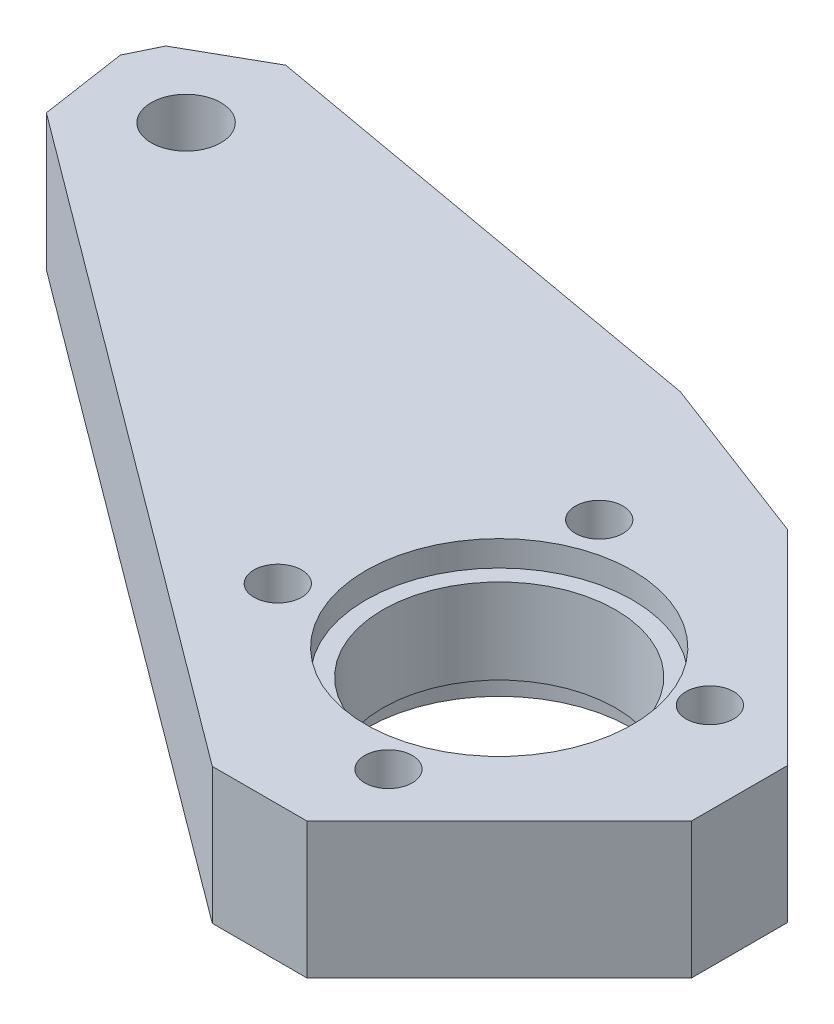
ISO-10303-21;
HEADER;
FILE_DESCRIPTION(('STEP AP214'),'2;1');
FILE_NAME('part.step','',(''),(''),'','','');
FILE_SCHEMA(('AUTOMOTIVE_DESIGN { 1 0 10303 214 1 1 1 1 }'));
ENDSEC;
DATA;
#1=APPLICATION_CONTEXT('core data for automotive mechanical design processes');
#2=APPLICATION_PROTOCOL_DEFINITION('international standard','automotive_design',2000,#1);
#3=PRODUCT_CONTEXT('',#1,'mechanical');
#4=PRODUCT('Part','Part','',(#3));
#5=PRODUCT_RELATED_PRODUCT_CATEGORY('part','',(#4));
#6=PRODUCT_DEFINITION_FORMATION('','',#4);
#7=PRODUCT_DEFINITION_CONTEXT('part definition',#1,'design');
#8=PRODUCT_DEFINITION('design','',#6,#7);
#9=PRODUCT_DEFINITION_SHAPE('','',#8);
#10=(LENGTH_UNIT() NAMED_UNIT(*) SI_UNIT(.MILLI.,.METRE.));
#11=(NAMED_UNIT(*) PLANE_ANGLE_UNIT() SI_UNIT($,.RADIAN.));
#12=(NAMED_UNIT(*) SI_UNIT($,.STERADIAN.) SOLID_ANGLE_UNIT());
#13=UNCERTAINTY_MEASURE_WITH_UNIT(LENGTH_MEASURE(1.E-05),#10,'distance_accuracy_value','');
#14=(GEOMETRIC_REPRESENTATION_CONTEXT(3) GLOBAL_UNCERTAINTY_ASSIGNED_CONTEXT((#13)) GLOBAL_UNIT_ASSIGNED_CONTEXT((#10,
#11,#12)) REPRESENTATION_CONTEXT('',''));
#15=CARTESIAN_POINT('',(0.,0.,0.));
#16=DIRECTION('',(0.,0.,1.));
#17=DIRECTION('',(1.,0.,0.));
#18=AXIS2_PLACEMENT_3D('',#15,#16,#17);
#19=CARTESIAN_POINT('',(100.000038384,-41.500004703,62.5));
#20=DIRECTION('',(0.,1.,0.));
#21=DIRECTION('',(-1.,0.,0.));
#22=AXIS2_PLACEMENT_3D('',#19,#20,#21);
#23=CYLINDRICAL_SURFACE('',#22,7.85);
#24=DIRECTION('',(0.,-1.,0.));
#25=VECTOR('',#24,1.);
#26=CARTESIAN_POINT('',(92.150038384,-35.500004703,62.5));
#27=LINE('',#26,#25);
#28=CARTESIAN_POINT('',(92.150038384,-35.500004703,62.5));
#29=VERTEX_POINT('',#28);
#30=CARTESIAN_POINT('',(92.150038384,-37.000004703,62.5));
#31=VERTEX_POINT('',#30);
#32=EDGE_CURVE('E11',#29,#31,#27,.T.);
#33=ORIENTED_EDGE('',*,*,#32,.F.);
#34=CARTESIAN_POINT('',(100.000038384,-35.500004703,62.5));
#35=DIRECTION('',(0.,-1.,0.));
#36=DIRECTION('',(0.,0.,-1.));
#37=AXIS2_PLACEMENT_3D('',#34,#35,#36);
#38=CIRCLE('',#37,7.85);
#39=CARTESIAN_POINT('',(100.000038384,-35.500004703,54.65));
#40=VERTEX_POINT('',#39);
#41=EDGE_CURVE('E56',#40,#29,#38,.T.);
#42=ORIENTED_EDGE('',*,*,#41,.F.);
#43=CARTESIAN_POINT('',(100.000038384,-35.500004703,62.5));
#44=DIRECTION('',(0.,-1.,0.));
#45=DIRECTION('',(0.,0.,-1.));
#46=AXIS2_PLACEMENT_3D('',#43,#44,#45);
#47=CIRCLE('',#46,7.85);
#48=EDGE_CURVE('E242',#29,#40,#47,.T.);
#49=ORIENTED_EDGE('',*,*,#48,.F.);
#50=ORIENTED_EDGE('',*,*,#32,.T.);
#51=CARTESIAN_POINT('',(100.000038384,-37.000004703,62.5));
#52=DIRECTION('',(0.,-1.,0.));
#53=DIRECTION('',(0.,0.,-1.));
#54=AXIS2_PLACEMENT_3D('',#51,#52,#53);
#55=CIRCLE('',#54,7.85);
#56=CARTESIAN_POINT('',(100.000038384,-37.000004703,54.65));
#57=VERTEX_POINT('',#56);
#58=EDGE_CURVE('E48',#31,#57,#55,.T.);
#59=ORIENTED_EDGE('',*,*,#58,.T.);
#60=CARTESIAN_POINT('',(100.000038384,-37.000004703,62.5));
#61=DIRECTION('',(0.,-1.,0.));
#62=DIRECTION('',(0.,0.,-1.));
#63=AXIS2_PLACEMENT_3D('',#60,#61,#62);
#64=CIRCLE('',#63,7.85);
#65=EDGE_CURVE('E331',#57,#31,#64,.T.);
#66=ORIENTED_EDGE('',*,*,#65,.T.);
#67=EDGE_LOOP('',(#33,#42,#49,#50,#59,#66));
#68=FACE_BOUND('',#67,.T.);
#69=ADVANCED_FACE('F38',(#68),#23,.F.);
#70=CARTESIAN_POINT('',(58.884612022,-41.500004703,43.005789131));
#71=DIRECTION('',(-0.898794046158572,0.,-0.438371147077341));
#72=DIRECTION('',(-0.438371147077341,0.,0.898794046158572));
#73=AXIS2_PLACEMENT_3D('',#70,#71,#72);
#74=PLANE('',#73);
#75=DIRECTION('',(-0.438371147077341,0.,0.898794046158572));
#76=VECTOR('',#75,1.);
#77=CARTESIAN_POINT('',(59.543280425,-35.500004703,41.655318775));
#78=LINE('',#77,#76);
#79=CARTESIAN_POINT('',(59.543280425,-35.500004703,41.655318775));
#80=VERTEX_POINT('',#79);
#81=CARTESIAN_POINT('',(58.666538131,-35.500004703,43.452906867));
#82=VERTEX_POINT('',#81);
#83=EDGE_CURVE('E240',#80,#82,#78,.T.);
#84=ORIENTED_EDGE('',*,*,#83,.F.);
#85=DIRECTION('',(0.,1.,0.));
#86=VECTOR('',#85,1.);
#87=CARTESIAN_POINT('',(59.543280425,-43.500004703,41.655318775));
#88=LINE('',#87,#86);
#89=CARTESIAN_POINT('',(59.543280425,-43.500004703,41.655318775));
#90=VERTEX_POINT('',#89);
#91=EDGE_CURVE('E303',#90,#80,#88,.T.);
#92=ORIENTED_EDGE('',*,*,#91,.F.);
#93=DIRECTION('',(-0.438371147077341,0.,0.898794046158572));
#94=VECTOR('',#93,1.);
#95=CARTESIAN_POINT('',(59.543280425,-43.500004703,41.655318775));
#96=LINE('',#95,#94);
#97=CARTESIAN_POINT('',(58.666538131,-43.500004703,43.452906867));
#98=VERTEX_POINT('',#97);
#99=EDGE_CURVE('E334',#90,#98,#96,.T.);
#100=ORIENTED_EDGE('',*,*,#99,.T.);
#101=DIRECTION('',(0.,1.,0.));
#102=VECTOR('',#101,1.);
#103=CARTESIAN_POINT('',(58.666538131,-43.500004703,43.452906867));
#104=LINE('',#103,#102);
#105=EDGE_CURVE('E302',#98,#82,#104,.T.);
#106=ORIENTED_EDGE('',*,*,#105,.T.);
#107=EDGE_LOOP('',(#84,#92,#100,#106));
#108=FACE_BOUND('',#107,.T.);
#109=ADVANCED_FACE('F411',(#108),#74,.T.);
#110=CARTESIAN_POINT('',(61.795778479,-41.500004703,40.380045681));
#111=DIRECTION('',(0.492678444125846,0.,0.87021144022228));
#112=DIRECTION('',(0.,-1.,0.));
#113=AXIS2_PLACEMENT_3D('',#110,#111,#112);
#114=PLANE('',#113);
#115=DIRECTION('',(0.87021144022228,0.,-0.492678444125846));
#116=VECTOR('',#115,1.);
#117=CARTESIAN_POINT('',(59.543280425,-35.500004703,41.655318775));
#118=LINE('',#117,#116);
#119=CARTESIAN_POINT('',(64.048276533,-35.500004703,39.104772588));
#120=VERTEX_POINT('',#119);
#121=EDGE_CURVE('E299',#80,#120,#118,.T.);
#122=ORIENTED_EDGE('',*,*,#121,.T.);
#123=DIRECTION('',(0.,1.,0.));
#124=VECTOR('',#123,1.);
#125=CARTESIAN_POINT('',(64.048276533,-43.500004703,39.104772588));
#126=LINE('',#125,#124);
#127=CARTESIAN_POINT('',(64.048276533,-43.500004703,39.104772588));
#128=VERTEX_POINT('',#127);
#129=EDGE_CURVE('E280',#128,#120,#126,.T.);
#130=ORIENTED_EDGE('',*,*,#129,.F.);
#131=DIRECTION('',(0.87021144022228,0.,-0.492678444125846));
#132=VECTOR('',#131,1.);
#133=CARTESIAN_POINT('',(59.543280425,-43.500004703,41.655318775));
#134=LINE('',#133,#132);
#135=EDGE_CURVE('E314',#90,#128,#134,.T.);
#136=ORIENTED_EDGE('',*,*,#135,.F.);
#137=ORIENTED_EDGE('',*,*,#91,.T.);
#138=EDGE_LOOP('',(#122,#130,#136,#137));
#139=FACE_BOUND('',#138,.T.);
#140=ADVANCED_FACE('F417',(#139),#114,.F.);
#141=CARTESIAN_POINT('',(67.774157459,-41.500004703,39.7682048));
#142=DIRECTION('',(0.175303142953365,0.,-0.984514503738097));
#143=DIRECTION('',(0.,-1.,0.));
#144=AXIS2_PLACEMENT_3D('',#141,#142,#143);
#145=PLANE('',#144);
#146=DIRECTION('',(-0.984514503738097,0.,-0.175303142953365));
#147=VECTOR('',#146,1.);
#148=CARTESIAN_POINT('',(92.286977054,-35.500004703,44.132969661));
#149=LINE('',#148,#147);
#150=CARTESIAN_POINT('',(92.286977054,-35.500004703,44.132969661));
#151=VERTEX_POINT('',#150);
#152=EDGE_CURVE('E234',#151,#120,#149,.T.);
#153=ORIENTED_EDGE('',*,*,#152,.F.);
#154=DIRECTION('',(0.,1.,0.));
#155=VECTOR('',#154,1.);
#156=CARTESIAN_POINT('',(92.286977054,-43.500004703,44.132969661));
#157=LINE('',#156,#155);
#158=CARTESIAN_POINT('',(92.286977054,-43.500004703,44.132969661));
#159=VERTEX_POINT('',#158);
#160=EDGE_CURVE('E288',#159,#151,#157,.T.);
#161=ORIENTED_EDGE('',*,*,#160,.F.);
#162=DIRECTION('',(-0.984514503738097,0.,-0.175303142953365));
#163=VECTOR('',#162,1.);
#164=CARTESIAN_POINT('',(92.286977054,-43.500004703,44.132969661));
#165=LINE('',#164,#163);
#166=EDGE_CURVE('E282',#159,#128,#165,.T.);
#167=ORIENTED_EDGE('',*,*,#166,.T.);
#168=ORIENTED_EDGE('',*,*,#129,.T.);
#169=EDGE_LOOP('',(#153,#161,#167,#168));
#170=FACE_BOUND('',#169,.T.);
#171=ADVANCED_FACE('F425',(#170),#145,.T.);
#172=CARTESIAN_POINT('',(97.380944586,-41.500004703,46.068640323));
#173=DIRECTION('',(0.355211827987967,0.,-0.934785834968335));
#174=DIRECTION('',(0.,-1.,0.));
#175=AXIS2_PLACEMENT_3D('',#172,#173,#174);
#176=PLANE('',#175);
#177=DIRECTION('',(-0.934785834968335,0.,-0.355211827987967));
#178=VECTOR('',#177,1.);
#179=CARTESIAN_POINT('',(102.474912119,-35.500004703,48.004310986));
#180=LINE('',#179,#178);
#181=CARTESIAN_POINT('',(102.474912119,-35.500004703,48.004310986));
#182=VERTEX_POINT('',#181);
#183=EDGE_CURVE('E236',#182,#151,#180,.T.);
#184=ORIENTED_EDGE('',*,*,#183,.F.);
#185=DIRECTION('',(0.,1.,0.));
#186=VECTOR('',#185,1.);
#187=CARTESIAN_POINT('',(102.474912119,-43.500004703,48.004310986));
#188=LINE('',#187,#186);
#189=CARTESIAN_POINT('',(102.474912119,-43.500004703,48.004310986));
#190=VERTEX_POINT('',#189);
#191=EDGE_CURVE('E261',#190,#182,#188,.T.);
#192=ORIENTED_EDGE('',*,*,#191,.F.);
#193=DIRECTION('',(-0.934785834968335,0.,-0.355211827987967));
#194=VECTOR('',#193,1.);
#195=CARTESIAN_POINT('',(102.474912119,-43.500004703,48.004310986));
#196=LINE('',#195,#194);
#197=EDGE_CURVE('E283',#190,#159,#196,.T.);
#198=ORIENTED_EDGE('',*,*,#197,.T.);
#199=ORIENTED_EDGE('',*,*,#160,.T.);
#200=EDGE_LOOP('',(#184,#192,#198,#199));
#201=FACE_BOUND('',#200,.T.);
#202=ADVANCED_FACE('F421',(#201),#176,.T.);
#203=CARTESIAN_POINT('',(111.490523579,-41.500004703,57.019922446));
#204=DIRECTION('',(-0.707106781186548,0.,0.707106781186548));
#205=DIRECTION('',(0.,1.,0.));
#206=AXIS2_PLACEMENT_3D('',#203,#204,#205);
#207=PLANE('',#206);
#208=DIRECTION('',(0.707106781186548,0.,0.707106781186548));
#209=VECTOR('',#208,1.);
#210=CARTESIAN_POINT('',(102.474912119,-35.500004703,48.004310986));
#211=LINE('',#210,#209);
#212=CARTESIAN_POINT('',(114.495727399,-35.500004703,60.025126266));
#213=VERTEX_POINT('',#212);
#214=EDGE_CURVE('E264',#182,#213,#211,.T.);
#215=ORIENTED_EDGE('',*,*,#214,.T.);
#216=DIRECTION('',(0.,1.,0.));
#217=VECTOR('',#216,1.);
#218=CARTESIAN_POINT('',(114.495727399,-43.500004703,60.025126266));
#219=LINE('',#218,#217);
#220=CARTESIAN_POINT('',(114.495727399,-43.500004703,60.025126266));
#221=VERTEX_POINT('',#220);
#222=EDGE_CURVE('E343',#221,#213,#219,.T.);
#223=ORIENTED_EDGE('',*,*,#222,.F.);
#224=DIRECTION('',(0.707106781186548,0.,0.707106781186548));
#225=VECTOR('',#224,1.);
#226=CARTESIAN_POINT('',(102.474912119,-43.500004703,48.004310986));
#227=LINE('',#226,#225);
#228=EDGE_CURVE('E321',#190,#221,#227,.T.);
#229=ORIENTED_EDGE('',*,*,#228,.F.);
#230=ORIENTED_EDGE('',*,*,#191,.T.);
#231=EDGE_LOOP('',(#215,#223,#229,#230));
#232=FACE_BOUND('',#231,.T.);
#233=ADVANCED_FACE('F424',(#232),#207,.F.);
#234=CARTESIAN_POINT('',(114.495727399,-41.500004703,62.853553391));
#235=DIRECTION('',(1.,0.,0.));
#236=DIRECTION('',(0.,1.,0.));
#237=AXIS2_PLACEMENT_3D('',#234,#235,#236);
#238=PLANE('',#237);
#239=DIRECTION('',(0.,0.,-1.));
#240=VECTOR('',#239,1.);
#241=CARTESIAN_POINT('',(114.495727399,-35.500004703,65.681980515));
#242=LINE('',#241,#240);
#243=CARTESIAN_POINT('',(114.495727399,-35.500004703,65.681980515));
#244=VERTEX_POINT('',#243);
#245=EDGE_CURVE('E239',#244,#213,#242,.T.);
#246=ORIENTED_EDGE('',*,*,#245,.F.);
#247=DIRECTION('',(0.,1.,0.));
#248=VECTOR('',#247,1.);
#249=CARTESIAN_POINT('',(114.495727399,-43.500004703,65.681980515));
#250=LINE('',#249,#248);
#251=CARTESIAN_POINT('',(114.495727399,-43.500004703,65.681980515));
#252=VERTEX_POINT('',#251);
#253=EDGE_CURVE('E307',#252,#244,#250,.T.);
#254=ORIENTED_EDGE('',*,*,#253,.F.);
#255=DIRECTION('',(0.,0.,-1.));
#256=VECTOR('',#255,1.);
#257=CARTESIAN_POINT('',(114.495727399,-43.500004703,65.681980515));
#258=LINE('',#257,#256);
#259=EDGE_CURVE('E265',#252,#221,#258,.T.);
#260=ORIENTED_EDGE('',*,*,#259,.T.);
#261=ORIENTED_EDGE('',*,*,#222,.T.);
#262=EDGE_LOOP('',(#246,#254,#260,#261));
#263=FACE_BOUND('',#262,.T.);
#264=ADVANCED_FACE('F585',(#263),#238,.T.);
#265=CARTESIAN_POINT('',(111.667300274,-41.500004703,68.51040764));
#266=DIRECTION('',(0.707106781186548,0.,0.707106781186548));
#267=DIRECTION('',(0.,-1.,0.));
#268=AXIS2_PLACEMENT_3D('',#265,#266,#267);
#269=PLANE('',#268);
#270=DIRECTION('',(0.707106781186548,0.,-0.707106781186548));
#271=VECTOR('',#270,1.);
#272=CARTESIAN_POINT('',(103.1820189,-35.500004703,76.995689014));
#273=LINE('',#272,#271);
#274=CARTESIAN_POINT('',(103.1820189,-35.500004703,76.995689014));
#275=VERTEX_POINT('',#274);
#276=EDGE_CURVE('E311',#275,#244,#273,.T.);
#277=ORIENTED_EDGE('',*,*,#276,.F.);
#278=DIRECTION('',(0.,1.,0.));
#279=VECTOR('',#278,1.);
#280=CARTESIAN_POINT('',(103.1820189,-43.500004703,76.995689014));
#281=LINE('',#280,#279);
#282=CARTESIAN_POINT('',(103.1820189,-43.500004703,76.995689014));
#283=VERTEX_POINT('',#282);
#284=EDGE_CURVE('E298',#283,#275,#281,.T.);
#285=ORIENTED_EDGE('',*,*,#284,.F.);
#286=DIRECTION('',(0.707106781186548,0.,-0.707106781186548));
#287=VECTOR('',#286,1.);
#288=CARTESIAN_POINT('',(103.1820189,-43.500004703,76.995689014));
#289=LINE('',#288,#287);
#290=EDGE_CURVE('E345',#283,#252,#289,.T.);
#291=ORIENTED_EDGE('',*,*,#290,.T.);
#292=ORIENTED_EDGE('',*,*,#253,.T.);
#293=EDGE_LOOP('',(#277,#285,#291,#292));
#294=FACE_BOUND('',#293,.T.);
#295=ADVANCED_FACE('F440',(#294),#269,.T.);
#296=CARTESIAN_POINT('',(100.3985189,-41.500004703,76.995689014));
#297=DIRECTION('',(0.,0.,-1.));
#298=DIRECTION('',(0.,-1.,0.));
#299=AXIS2_PLACEMENT_3D('',#296,#297,#298);
#300=PLANE('',#299);
#301=DIRECTION('',(-1.,0.,0.));
#302=VECTOR('',#301,1.);
#303=CARTESIAN_POINT('',(103.1820189,-35.500004703,76.995689014));
#304=LINE('',#303,#302);
#305=CARTESIAN_POINT('',(97.6150189,-35.500004703,76.995689014));
#306=VERTEX_POINT('',#305);
#307=EDGE_CURVE('E304',#275,#306,#304,.T.);
#308=ORIENTED_EDGE('',*,*,#307,.T.);
#309=DIRECTION('',(0.,1.,0.));
#310=VECTOR('',#309,1.);
#311=CARTESIAN_POINT('',(97.6150189,-43.500004703,76.995689014));
#312=LINE('',#311,#310);
#313=CARTESIAN_POINT('',(97.6150189,-43.500004703,76.995689014));
#314=VERTEX_POINT('',#313);
#315=EDGE_CURVE('E252',#314,#306,#312,.T.);
#316=ORIENTED_EDGE('',*,*,#315,.F.);
#317=DIRECTION('',(-1.,0.,0.));
#318=VECTOR('',#317,1.);
#319=CARTESIAN_POINT('',(103.1820189,-43.500004703,76.995689014));
#320=LINE('',#319,#318);
#321=EDGE_CURVE('E323',#283,#314,#320,.T.);
#322=ORIENTED_EDGE('',*,*,#321,.F.);
#323=ORIENTED_EDGE('',*,*,#284,.T.);
#324=EDGE_LOOP('',(#308,#316,#322,#323));
#325=FACE_BOUND('',#324,.T.);
#326=ADVANCED_FACE('F438',(#325),#300,.F.);
#327=CARTESIAN_POINT('',(78.522625879,-41.500004703,62.784427144));
#328=DIRECTION('',(0.597091058794646,0.,-0.802173464724113));
#329=DIRECTION('',(0.,-1.,0.));
#330=AXIS2_PLACEMENT_3D('',#327,#328,#329);
#331=PLANE('',#330);
#332=DIRECTION('',(-0.802173464724113,0.,-0.597091058794646));
#333=VECTOR('',#332,1.);
#334=CARTESIAN_POINT('',(97.6150189,-35.500004703,76.995689014));
#335=LINE('',#334,#333);
#336=CARTESIAN_POINT('',(59.430232858,-35.500004703,48.573165274));
#337=VERTEX_POINT('',#336);
#338=EDGE_CURVE('E295',#306,#337,#335,.T.);
#339=ORIENTED_EDGE('',*,*,#338,.T.);
#340=DIRECTION('',(0.,1.,0.));
#341=VECTOR('',#340,1.);
#342=CARTESIAN_POINT('',(59.430232858,-43.500004703,48.573165274));
#343=LINE('',#342,#341);
#344=CARTESIAN_POINT('',(59.430232858,-43.500004703,48.573165274));
#345=VERTEX_POINT('',#344);
#346=EDGE_CURVE('E266',#345,#337,#343,.T.);
#347=ORIENTED_EDGE('',*,*,#346,.F.);
#348=DIRECTION('',(-0.802173464724113,0.,-0.597091058794646));
#349=VECTOR('',#348,1.);
#350=CARTESIAN_POINT('',(97.6150189,-43.500004703,76.995689014));
#351=LINE('',#350,#349);
#352=EDGE_CURVE('E42',#314,#345,#351,.T.);
#353=ORIENTED_EDGE('',*,*,#352,.F.);
#354=ORIENTED_EDGE('',*,*,#315,.T.);
#355=EDGE_LOOP('',(#339,#347,#353,#354));
#356=FACE_BOUND('',#355,.T.);
#357=ADVANCED_FACE('F436',(#356),#331,.F.);
#358=CARTESIAN_POINT('',(102.940745878,-41.500004703,71.955185756));
#359=DIRECTION('',(0.,1.,0.));
#360=DIRECTION('',(-1.,0.,0.));
#361=AXIS2_PLACEMENT_3D('',#358,#359,#360);
#362=CYLINDRICAL_SURFACE('',#361,1.4);
#363=DIRECTION('',(0.,-1.,0.));
#364=VECTOR('',#363,1.);
#365=CARTESIAN_POINT('',(101.540745878,-35.500004703,71.955185756));
#366=LINE('',#365,#364);
#367=CARTESIAN_POINT('',(101.540745878,-35.500004703,71.955185756));
#368=VERTEX_POINT('',#367);
#369=CARTESIAN_POINT('',(101.540745878,-43.500004703,71.955185756));
#370=VERTEX_POINT('',#369);
#371=EDGE_CURVE('E218',#368,#370,#366,.T.);
#372=ORIENTED_EDGE('',*,*,#371,.F.);
#373=CARTESIAN_POINT('',(102.940745878,-35.500004703,71.955185756));
#374=DIRECTION('',(0.,-1.,0.));
#375=DIRECTION('',(1.,0.,0.));
#376=AXIS2_PLACEMENT_3D('',#373,#374,#375);
#377=CIRCLE('',#376,1.4);
#378=CARTESIAN_POINT('',(104.340745878,-35.500004703,71.955185756));
#379=VERTEX_POINT('',#378);
#380=EDGE_CURVE('E212',#379,#368,#377,.T.);
#381=ORIENTED_EDGE('',*,*,#380,.F.);
#382=CARTESIAN_POINT('',(102.940745878,-35.500004703,71.955185756));
#383=DIRECTION('',(0.,-1.,0.));
#384=DIRECTION('',(1.,0.,0.));
#385=AXIS2_PLACEMENT_3D('',#382,#383,#384);
#386=CIRCLE('',#385,1.4);
#387=EDGE_CURVE('E216',#368,#379,#386,.T.);
#388=ORIENTED_EDGE('',*,*,#387,.F.);
#389=ORIENTED_EDGE('',*,*,#371,.T.);
#390=CARTESIAN_POINT('',(102.940745878,-43.500004703,71.955185756));
#391=DIRECTION('',(0.,-1.,0.));
#392=DIRECTION('',(0.,0.,-1.));
#393=AXIS2_PLACEMENT_3D('',#390,#391,#392);
#394=CIRCLE('',#393,1.4);
#395=CARTESIAN_POINT('',(102.940745878,-43.500004703,70.555185756));
#396=VERTEX_POINT('',#395);
#397=EDGE_CURVE('E253',#370,#396,#394,.T.);
#398=ORIENTED_EDGE('',*,*,#397,.T.);
#399=CARTESIAN_POINT('',(102.940745878,-43.500004703,71.955185756));
#400=DIRECTION('',(0.,-1.,0.));
#401=DIRECTION('',(0.,0.,-1.));
#402=AXIS2_PLACEMENT_3D('',#399,#400,#401);
#403=CIRCLE('',#402,1.4);
#404=EDGE_CURVE('E290',#396,#370,#403,.T.);
#405=ORIENTED_EDGE('',*,*,#404,.T.);
#406=EDGE_LOOP('',(#372,#381,#388,#389,#398,#405));
#407=FACE_BOUND('',#406,.T.);
#408=ADVANCED_FACE('F214',(#407),#362,.F.);
#409=CARTESIAN_POINT('',(90.229878577,-41.500004703,65.755681545));
#410=DIRECTION('',(0.,1.,0.));
#411=DIRECTION('',(-1.,0.,0.));
#412=AXIS2_PLACEMENT_3D('',#409,#410,#411);
#413=CYLINDRICAL_SURFACE('',#412,1.4);
#414=DIRECTION('',(0.,-1.,0.));
#415=VECTOR('',#414,1.);
#416=CARTESIAN_POINT('',(88.829878577,-35.500004703,65.755681545));
#417=LINE('',#416,#415);
#418=CARTESIAN_POINT('',(88.829878577,-35.500004703,65.755681545));
#419=VERTEX_POINT('',#418);
#420=CARTESIAN_POINT('',(88.829878577,-43.500004703,65.755681545));
#421=VERTEX_POINT('',#420);
#422=EDGE_CURVE('E246',#419,#421,#417,.T.);
#423=ORIENTED_EDGE('',*,*,#422,.F.);
#424=CARTESIAN_POINT('',(90.229878577,-35.500004703,65.755681545));
#425=DIRECTION('',(0.,-1.,0.));
#426=DIRECTION('',(1.,0.,0.));
#427=AXIS2_PLACEMENT_3D('',#424,#425,#426);
#428=CIRCLE('',#427,1.4);
#429=CARTESIAN_POINT('',(91.629878577,-35.500004703,65.755681545));
#430=VERTEX_POINT('',#429);
#431=EDGE_CURVE('E256',#430,#419,#428,.T.);
#432=ORIENTED_EDGE('',*,*,#431,.F.);
#433=CARTESIAN_POINT('',(90.229878577,-35.500004703,65.755681545));
#434=DIRECTION('',(0.,-1.,0.));
#435=DIRECTION('',(1.,0.,0.));
#436=AXIS2_PLACEMENT_3D('',#433,#434,#435);
#437=CIRCLE('',#436,1.4);
#438=EDGE_CURVE('E220',#419,#430,#437,.T.);
#439=ORIENTED_EDGE('',*,*,#438,.F.);
#440=ORIENTED_EDGE('',*,*,#422,.T.);
#441=CARTESIAN_POINT('',(90.229878577,-43.500004703,65.755681545));
#442=DIRECTION('',(0.,-1.,0.));
#443=DIRECTION('',(0.,0.,-1.));
#444=AXIS2_PLACEMENT_3D('',#441,#442,#443);
#445=CIRCLE('',#444,1.4);
#446=CARTESIAN_POINT('',(90.229878577,-43.500004703,64.355681545));
#447=VERTEX_POINT('',#446);
#448=EDGE_CURVE('E244',#421,#447,#445,.T.);
#449=ORIENTED_EDGE('',*,*,#448,.T.);
#450=CARTESIAN_POINT('',(90.229878577,-43.500004703,65.755681545));
#451=DIRECTION('',(0.,-1.,0.));
#452=DIRECTION('',(0.,0.,-1.));
#453=AXIS2_PLACEMENT_3D('',#450,#451,#452);
#454=CIRCLE('',#453,1.4);
#455=EDGE_CURVE('E247',#447,#421,#454,.T.);
#456=ORIENTED_EDGE('',*,*,#455,.T.);
#457=EDGE_LOOP('',(#423,#432,#439,#440,#449,#456));
#458=FACE_BOUND('',#457,.T.);
#459=ADVANCED_FACE('F435',(#458),#413,.F.);
#460=CARTESIAN_POINT('',(64.046053168,-41.500004703,44.969712702));
#461=DIRECTION('',(0.,1.,0.));
#462=DIRECTION('',(-1.,0.,0.));
#463=AXIS2_PLACEMENT_3D('',#460,#461,#462);
#464=CYLINDRICAL_SURFACE('',#463,2.05);
#465=DIRECTION('',(0.,-1.,0.));
#466=VECTOR('',#465,1.);
#467=CARTESIAN_POINT('',(61.996053168,-35.500004703,44.969712702));
#468=LINE('',#467,#466);
#469=CARTESIAN_POINT('',(61.996053168,-35.500004703,44.969712702));
#470=VERTEX_POINT('',#469);
#471=CARTESIAN_POINT('',(61.996053168,-43.500004703,44.969712702));
#472=VERTEX_POINT('',#471);
#473=EDGE_CURVE('E272',#470,#472,#468,.T.);
#474=ORIENTED_EDGE('',*,*,#473,.F.);
#475=CARTESIAN_POINT('',(64.046053168,-35.500004703,44.969712702));
#476=DIRECTION('',(0.,-1.,0.));
#477=DIRECTION('',(0.,0.,-1.));
#478=AXIS2_PLACEMENT_3D('',#475,#476,#477);
#479=CIRCLE('',#478,2.05);
#480=CARTESIAN_POINT('',(64.046053168,-35.500004703,42.919712702));
#481=VERTEX_POINT('',#480);
#482=EDGE_CURVE('E248',#481,#470,#479,.T.);
#483=ORIENTED_EDGE('',*,*,#482,.F.);
#484=CARTESIAN_POINT('',(64.046053168,-35.500004703,44.969712702));
#485=DIRECTION('',(0.,-1.,0.));
#486=DIRECTION('',(0.,0.,-1.));
#487=AXIS2_PLACEMENT_3D('',#484,#485,#486);
#488=CIRCLE('',#487,2.05);
#489=EDGE_CURVE('E250',#470,#481,#488,.T.);
#490=ORIENTED_EDGE('',*,*,#489,.F.);
#491=ORIENTED_EDGE('',*,*,#473,.T.);
#492=CARTESIAN_POINT('',(64.046053168,-43.500004703,44.969712702));
#493=DIRECTION('',(0.,-1.,0.));
#494=DIRECTION('',(0.,0.,-1.));
#495=AXIS2_PLACEMENT_3D('',#492,#493,#494);
#496=CIRCLE('',#495,2.05);
#497=CARTESIAN_POINT('',(64.046053168,-43.500004703,42.919712702));
#498=VERTEX_POINT('',#497);
#499=EDGE_CURVE('E349',#472,#498,#496,.T.);
#500=ORIENTED_EDGE('',*,*,#499,.T.);
#501=CARTESIAN_POINT('',(64.046053168,-43.500004703,44.969712702));
#502=DIRECTION('',(0.,-1.,0.));
#503=DIRECTION('',(0.,0.,-1.));
#504=AXIS2_PLACEMENT_3D('',#501,#502,#503);
#505=CIRCLE('',#504,2.05);
#506=EDGE_CURVE('E351',#498,#472,#505,.T.);
#507=ORIENTED_EDGE('',*,*,#506,.T.);
#508=EDGE_LOOP('',(#474,#483,#490,#491,#500,#507));
#509=FACE_BOUND('',#508,.T.);
#510=ADVANCED_FACE('F40',(#509),#464,.F.);
#511=CARTESIAN_POINT('',(109.140250089,-41.500004703,59.244318455));
#512=DIRECTION('',(0.,1.,0.));
#513=DIRECTION('',(-1.,0.,0.));
#514=AXIS2_PLACEMENT_3D('',#511,#512,#513);
#515=CYLINDRICAL_SURFACE('',#514,1.4);
#516=DIRECTION('',(0.,-1.,0.));
#517=VECTOR('',#516,1.);
#518=CARTESIAN_POINT('',(107.740250089,-35.500004703,59.244318455));
#519=LINE('',#518,#517);
#520=CARTESIAN_POINT('',(107.740250089,-35.500004703,59.244318455));
#521=VERTEX_POINT('',#520);
#522=CARTESIAN_POINT('',(107.740250089,-43.500004703,59.244318455));
#523=VERTEX_POINT('',#522);
#524=EDGE_CURVE('E360',#521,#523,#519,.T.);
#525=ORIENTED_EDGE('',*,*,#524,.F.);
#526=CARTESIAN_POINT('',(109.140250089,-35.500004703,59.244318455));
#527=DIRECTION('',(0.,-1.,0.));
#528=DIRECTION('',(1.,0.,0.));
#529=AXIS2_PLACEMENT_3D('',#526,#527,#528);
#530=CIRCLE('',#529,1.4);
#531=CARTESIAN_POINT('',(110.540250089,-35.500004703,59.244318455));
#532=VERTEX_POINT('',#531);
#533=EDGE_CURVE('E232',#532,#521,#530,.T.);
#534=ORIENTED_EDGE('',*,*,#533,.F.);
#535=CARTESIAN_POINT('',(109.140250089,-35.500004703,59.244318455));
#536=DIRECTION('',(0.,-1.,0.));
#537=DIRECTION('',(1.,0.,0.));
#538=AXIS2_PLACEMENT_3D('',#535,#536,#537);
#539=CIRCLE('',#538,1.4);
#540=EDGE_CURVE('E235',#521,#532,#539,.T.);
#541=ORIENTED_EDGE('',*,*,#540,.F.);
#542=ORIENTED_EDGE('',*,*,#524,.T.);
#543=CARTESIAN_POINT('',(109.140250089,-43.500004703,59.244318455));
#544=DIRECTION('',(0.,-1.,0.));
#545=DIRECTION('',(0.,0.,-1.));
#546=AXIS2_PLACEMENT_3D('',#543,#544,#545);
#547=CIRCLE('',#546,1.4);
#548=CARTESIAN_POINT('',(109.140250089,-43.500004703,57.844318455));
#549=VERTEX_POINT('',#548);
#550=EDGE_CURVE('E230',#523,#549,#547,.T.);
#551=ORIENTED_EDGE('',*,*,#550,.T.);
#552=CARTESIAN_POINT('',(109.140250089,-43.500004703,59.244318455));
#553=DIRECTION('',(0.,-1.,0.));
#554=DIRECTION('',(0.,0.,-1.));
#555=AXIS2_PLACEMENT_3D('',#552,#553,#554);
#556=CIRCLE('',#555,1.4);
#557=EDGE_CURVE('E328',#549,#523,#556,.T.);
#558=ORIENTED_EDGE('',*,*,#557,.T.);
#559=EDGE_LOOP('',(#525,#534,#541,#542,#551,#558));
#560=FACE_BOUND('',#559,.T.);
#561=ADVANCED_FACE('F532',(#560),#515,.F.);
#562=CARTESIAN_POINT('',(59.048385495,-41.500004703,46.013036071));
#563=DIRECTION('',(-0.989059110454982,0.,0.14751974791871));
#564=DIRECTION('',(0.,1.,0.));
#565=AXIS2_PLACEMENT_3D('',#562,#563,#564);
#566=PLANE('',#565);
#567=DIRECTION('',(0.14751974791871,0.,0.989059110454982));
#568=VECTOR('',#567,1.);
#569=CARTESIAN_POINT('',(58.666538131,-35.500004703,43.452906867));
#570=LINE('',#569,#568);
#571=EDGE_CURVE('E243',#82,#337,#570,.T.);
#572=ORIENTED_EDGE('',*,*,#571,.F.);
#573=ORIENTED_EDGE('',*,*,#105,.F.);
#574=DIRECTION('',(0.14751974791871,0.,0.989059110454982));
#575=VECTOR('',#574,1.);
#576=CARTESIAN_POINT('',(58.666538131,-43.500004703,43.452906867));
#577=LINE('',#576,#575);
#578=EDGE_CURVE('E268',#98,#345,#577,.T.);
#579=ORIENTED_EDGE('',*,*,#578,.T.);
#580=ORIENTED_EDGE('',*,*,#346,.T.);
#581=EDGE_LOOP('',(#572,#573,#579,#580));
#582=FACE_BOUND('',#581,.T.);
#583=ADVANCED_FACE('F456',(#582),#566,.T.);
#584=CARTESIAN_POINT('',(100.000038384,-41.500004703,62.5));
#585=DIRECTION('',(0.,1.,0.));
#586=DIRECTION('',(-1.,0.,0.));
#587=AXIS2_PLACEMENT_3D('',#584,#585,#586);
#588=CYLINDRICAL_SURFACE('',#587,7.8);
#589=DIRECTION('',(0.,-1.,0.));
#590=VECTOR('',#589,1.);
#591=CARTESIAN_POINT('',(92.200038384,-42.000004703,62.5));
#592=LINE('',#591,#590);
#593=CARTESIAN_POINT('',(92.200038384,-42.000004703,62.5));
#594=VERTEX_POINT('',#593);
#595=CARTESIAN_POINT('',(92.200038384,-43.500004703,62.5));
#596=VERTEX_POINT('',#595);
#597=EDGE_CURVE('E269',#594,#596,#592,.T.);
#598=ORIENTED_EDGE('',*,*,#597,.F.);
#599=CARTESIAN_POINT('',(100.000038384,-42.000004703,62.5));
#600=DIRECTION('',(0.,-1.,0.));
#601=DIRECTION('',(0.,0.,-1.));
#602=AXIS2_PLACEMENT_3D('',#599,#600,#601);
#603=CIRCLE('',#602,7.8);
#604=CARTESIAN_POINT('',(100.000038384,-42.000004703,54.7));
#605=VERTEX_POINT('',#604);
#606=EDGE_CURVE('E260',#605,#594,#603,.T.);
#607=ORIENTED_EDGE('',*,*,#606,.F.);
#608=CARTESIAN_POINT('',(100.000038384,-42.000004703,62.5));
#609=DIRECTION('',(0.,-1.,0.));
#610=DIRECTION('',(0.,0.,-1.));
#611=AXIS2_PLACEMENT_3D('',#608,#609,#610);
#612=CIRCLE('',#611,7.8);
#613=EDGE_CURVE('E293',#594,#605,#612,.T.);
#614=ORIENTED_EDGE('',*,*,#613,.F.);
#615=ORIENTED_EDGE('',*,*,#597,.T.);
#616=CARTESIAN_POINT('',(100.000038384,-43.500004703,62.5));
#617=DIRECTION('',(0.,-1.,0.));
#618=DIRECTION('',(0.,0.,-1.));
#619=AXIS2_PLACEMENT_3D('',#616,#617,#618);
#620=CIRCLE('',#619,7.8);
#621=CARTESIAN_POINT('',(100.000038384,-43.500004703,54.7));
#622=VERTEX_POINT('',#621);
#623=EDGE_CURVE('E324',#596,#622,#620,.T.);
#624=ORIENTED_EDGE('',*,*,#623,.T.);
#625=CARTESIAN_POINT('',(100.000038384,-43.500004703,62.5));
#626=DIRECTION('',(0.,-1.,0.));
#627=DIRECTION('',(0.,0.,-1.));
#628=AXIS2_PLACEMENT_3D('',#625,#626,#627);
#629=CIRCLE('',#628,7.8);
#630=EDGE_CURVE('E278',#622,#596,#629,.T.);
#631=ORIENTED_EDGE('',*,*,#630,.T.);
#632=EDGE_LOOP('',(#598,#607,#614,#615,#624,#631));
#633=FACE_BOUND('',#632,.T.);
#634=ADVANCED_FACE('F429',(#633),#588,.F.);
#635=CARTESIAN_POINT('',(96.429382788,-41.500004703,53.044814244));
#636=DIRECTION('',(0.,1.,0.));
#637=DIRECTION('',(-1.,0.,0.));
#638=AXIS2_PLACEMENT_3D('',#635,#636,#637);
#639=CYLINDRICAL_SURFACE('',#638,1.4);
#640=DIRECTION('',(0.,-1.,0.));
#641=VECTOR('',#640,1.);
#642=CARTESIAN_POINT('',(95.029382788,-35.500004703,53.044814244));
#643=LINE('',#642,#641);
#644=CARTESIAN_POINT('',(95.029382788,-35.500004703,53.044814244));
#645=VERTEX_POINT('',#644);
#646=CARTESIAN_POINT('',(95.029382788,-43.500004703,53.044814244));
#647=VERTEX_POINT('',#646);
#648=EDGE_CURVE('E275',#645,#647,#643,.T.);
#649=ORIENTED_EDGE('',*,*,#648,.F.);
#650=CARTESIAN_POINT('',(96.429382788,-35.500004703,53.044814244));
#651=DIRECTION('',(0.,-1.,0.));
#652=DIRECTION('',(1.,0.,0.));
#653=AXIS2_PLACEMENT_3D('',#650,#651,#652);
#654=CIRCLE('',#653,1.4);
#655=CARTESIAN_POINT('',(97.829382788,-35.500004703,53.044814244));
#656=VERTEX_POINT('',#655);
#657=EDGE_CURVE('E224',#656,#645,#654,.T.);
#658=ORIENTED_EDGE('',*,*,#657,.F.);
#659=CARTESIAN_POINT('',(96.429382788,-35.500004703,53.044814244));
#660=DIRECTION('',(0.,-1.,0.));
#661=DIRECTION('',(1.,0.,0.));
#662=AXIS2_PLACEMENT_3D('',#659,#660,#661);
#663=CIRCLE('',#662,1.4);
#664=EDGE_CURVE('E226',#645,#656,#663,.T.);
#665=ORIENTED_EDGE('',*,*,#664,.F.);
#666=ORIENTED_EDGE('',*,*,#648,.T.);
#667=CARTESIAN_POINT('',(96.429382788,-43.500004703,53.044814244));
#668=DIRECTION('',(0.,-1.,0.));
#669=DIRECTION('',(0.,0.,-1.));
#670=AXIS2_PLACEMENT_3D('',#667,#668,#669);
#671=CIRCLE('',#670,1.4);
#672=CARTESIAN_POINT('',(96.429382788,-43.500004703,51.644814244));
#673=VERTEX_POINT('',#672);
#674=EDGE_CURVE('E279',#647,#673,#671,.T.);
#675=ORIENTED_EDGE('',*,*,#674,.T.);
#676=CARTESIAN_POINT('',(96.429382788,-43.500004703,53.044814244));
#677=DIRECTION('',(0.,-1.,0.));
#678=DIRECTION('',(0.,0.,-1.));
#679=AXIS2_PLACEMENT_3D('',#676,#677,#678);
#680=CIRCLE('',#679,1.4);
#681=EDGE_CURVE('E285',#673,#647,#680,.T.);
#682=ORIENTED_EDGE('',*,*,#681,.T.);
#683=EDGE_LOOP('',(#649,#658,#665,#666,#675,#682));
#684=FACE_BOUND('',#683,.T.);
#685=ADVANCED_FACE('F393',(#684),#639,.F.);
#686=CARTESIAN_POINT('',(-206.266697519,-43.500004703,299.965154128));
#687=DIRECTION('',(0.,-1.,0.));
#688=DIRECTION('',(0.,0.,-1.));
#689=AXIS2_PLACEMENT_3D('',#686,#687,#688);
#690=PLANE('',#689);
#691=ORIENTED_EDGE('',*,*,#623,.F.);
#692=ORIENTED_EDGE('',*,*,#630,.F.);
#693=EDGE_LOOP('',(#691,#692));
#694=FACE_BOUND('',#693,.T.);
#695=ORIENTED_EDGE('',*,*,#99,.F.);
#696=ORIENTED_EDGE('',*,*,#135,.T.);
#697=ORIENTED_EDGE('',*,*,#166,.F.);
#698=ORIENTED_EDGE('',*,*,#197,.F.);
#699=ORIENTED_EDGE('',*,*,#228,.T.);
#700=ORIENTED_EDGE('',*,*,#259,.F.);
#701=ORIENTED_EDGE('',*,*,#290,.F.);
#702=ORIENTED_EDGE('',*,*,#321,.T.);
#703=ORIENTED_EDGE('',*,*,#352,.T.);
#704=ORIENTED_EDGE('',*,*,#578,.F.);
#705=EDGE_LOOP('',(#695,#696,#697,#698,#699,#700,#701,#702,#703,#704));
#706=FACE_BOUND('',#705,.T.);
#707=ORIENTED_EDGE('',*,*,#550,.F.);
#708=ORIENTED_EDGE('',*,*,#557,.F.);
#709=EDGE_LOOP('',(#707,#708));
#710=FACE_BOUND('',#709,.T.);
#711=ORIENTED_EDGE('',*,*,#499,.F.);
#712=ORIENTED_EDGE('',*,*,#506,.F.);
#713=EDGE_LOOP('',(#711,#712));
#714=FACE_BOUND('',#713,.T.);
#715=ORIENTED_EDGE('',*,*,#448,.F.);
#716=ORIENTED_EDGE('',*,*,#455,.F.);
#717=EDGE_LOOP('',(#715,#716));
#718=FACE_BOUND('',#717,.T.);
#719=ORIENTED_EDGE('',*,*,#397,.F.);
#720=ORIENTED_EDGE('',*,*,#404,.F.);
#721=EDGE_LOOP('',(#719,#720));
#722=FACE_BOUND('',#721,.T.);
#723=ORIENTED_EDGE('',*,*,#674,.F.);
#724=ORIENTED_EDGE('',*,*,#681,.F.);
#725=EDGE_LOOP('',(#723,#724));
#726=FACE_BOUND('',#725,.T.);
#727=ADVANCED_FACE('F377',(#694,#706,#710,#714,#718,#722,#726),#690,.T.);
#728=CARTESIAN_POINT('',(-206.266697519,-35.500004703,299.965154128));
#729=DIRECTION('',(0.,-1.,0.));
#730=DIRECTION('',(0.,0.,-1.));
#731=AXIS2_PLACEMENT_3D('',#728,#729,#730);
#732=PLANE('',#731);
#733=ORIENTED_EDGE('',*,*,#41,.T.);
#734=ORIENTED_EDGE('',*,*,#48,.T.);
#735=EDGE_LOOP('',(#733,#734));
#736=FACE_BOUND('',#735,.T.);
#737=ORIENTED_EDGE('',*,*,#83,.T.);
#738=ORIENTED_EDGE('',*,*,#571,.T.);
#739=ORIENTED_EDGE('',*,*,#338,.F.);
#740=ORIENTED_EDGE('',*,*,#307,.F.);
#741=ORIENTED_EDGE('',*,*,#276,.T.);
#742=ORIENTED_EDGE('',*,*,#245,.T.);
#743=ORIENTED_EDGE('',*,*,#214,.F.);
#744=ORIENTED_EDGE('',*,*,#183,.T.);
#745=ORIENTED_EDGE('',*,*,#152,.T.);
#746=ORIENTED_EDGE('',*,*,#121,.F.);
#747=EDGE_LOOP('',(#737,#738,#739,#740,#741,#742,#743,#744,#745,#746));
#748=FACE_BOUND('',#747,.T.);
#749=ORIENTED_EDGE('',*,*,#533,.T.);
#750=ORIENTED_EDGE('',*,*,#540,.T.);
#751=EDGE_LOOP('',(#749,#750));
#752=FACE_BOUND('',#751,.T.);
#753=ORIENTED_EDGE('',*,*,#482,.T.);
#754=ORIENTED_EDGE('',*,*,#489,.T.);
#755=EDGE_LOOP('',(#753,#754));
#756=FACE_BOUND('',#755,.T.);
#757=ORIENTED_EDGE('',*,*,#431,.T.);
#758=ORIENTED_EDGE('',*,*,#438,.T.);
#759=EDGE_LOOP('',(#757,#758));
#760=FACE_BOUND('',#759,.T.);
#761=ORIENTED_EDGE('',*,*,#380,.T.);
#762=ORIENTED_EDGE('',*,*,#387,.T.);
#763=EDGE_LOOP('',(#761,#762));
#764=FACE_BOUND('',#763,.T.);
#765=ORIENTED_EDGE('',*,*,#657,.T.);
#766=ORIENTED_EDGE('',*,*,#664,.T.);
#767=EDGE_LOOP('',(#765,#766));
#768=FACE_BOUND('',#767,.T.);
#769=ADVANCED_FACE('F222',(#736,#748,#752,#756,#760,#764,#768),#732,.F.);
#770=CARTESIAN_POINT('',(100.000038384,-40.500004703,62.5));
#771=DIRECTION('',(0.,1.,0.));
#772=DIRECTION('',(-1.,0.,0.));
#773=AXIS2_PLACEMENT_3D('',#770,#771,#772);
#774=CYLINDRICAL_SURFACE('',#773,6.85);
#775=DIRECTION('',(0.,-1.,0.));
#776=VECTOR('',#775,1.);
#777=CARTESIAN_POINT('',(93.150038384,-37.000004703,62.5));
#778=LINE('',#777,#776);
#779=CARTESIAN_POINT('',(93.150038384,-37.000004703,62.5));
#780=VERTEX_POINT('',#779);
#781=CARTESIAN_POINT('',(93.150038384,-42.000004703,62.5));
#782=VERTEX_POINT('',#781);
#783=EDGE_CURVE('E383',#780,#782,#778,.T.);
#784=ORIENTED_EDGE('',*,*,#783,.F.);
#785=CARTESIAN_POINT('',(100.000038384,-37.000004703,62.5));
#786=DIRECTION('',(0.,-1.,0.));
#787=DIRECTION('',(0.,0.,-1.));
#788=AXIS2_PLACEMENT_3D('',#785,#786,#787);
#789=CIRCLE('',#788,6.85);
#790=CARTESIAN_POINT('',(100.000038384,-37.000004703,55.65));
#791=VERTEX_POINT('',#790);
#792=EDGE_CURVE('E113',#791,#780,#789,.T.);
#793=ORIENTED_EDGE('',*,*,#792,.F.);
#794=CARTESIAN_POINT('',(100.000038384,-37.000004703,62.5));
#795=DIRECTION('',(0.,-1.,0.));
#796=DIRECTION('',(0.,0.,-1.));
#797=AXIS2_PLACEMENT_3D('',#794,#795,#796);
#798=CIRCLE('',#797,6.85);
#799=EDGE_CURVE('E294',#780,#791,#798,.T.);
#800=ORIENTED_EDGE('',*,*,#799,.F.);
#801=ORIENTED_EDGE('',*,*,#783,.T.);
#802=CARTESIAN_POINT('',(100.000038384,-42.000004703,62.5));
#803=DIRECTION('',(0.,-1.,0.));
#804=DIRECTION('',(0.,0.,-1.));
#805=AXIS2_PLACEMENT_3D('',#802,#803,#804);
#806=CIRCLE('',#805,6.85);
#807=CARTESIAN_POINT('',(100.000038384,-42.000004703,55.65));
#808=VERTEX_POINT('',#807);
#809=EDGE_CURVE('E105',#782,#808,#806,.T.);
#810=ORIENTED_EDGE('',*,*,#809,.T.);
#811=CARTESIAN_POINT('',(100.000038384,-42.000004703,62.5));
#812=DIRECTION('',(0.,-1.,0.));
#813=DIRECTION('',(0.,0.,-1.));
#814=AXIS2_PLACEMENT_3D('',#811,#812,#813);
#815=CIRCLE('',#814,6.85);
#816=EDGE_CURVE('E257',#808,#782,#815,.T.);
#817=ORIENTED_EDGE('',*,*,#816,.T.);
#818=EDGE_LOOP('',(#784,#793,#800,#801,#810,#817));
#819=FACE_BOUND('',#818,.T.);
#820=ADVANCED_FACE('F400',(#819),#774,.F.);
#821=CARTESIAN_POINT('',(-206.266697519,-42.000004703,299.965154128));
#822=DIRECTION('',(0.,-1.,0.));
#823=DIRECTION('',(0.,0.,-1.));
#824=AXIS2_PLACEMENT_3D('',#821,#822,#823);
#825=PLANE('',#824);
#826=ORIENTED_EDGE('',*,*,#606,.T.);
#827=ORIENTED_EDGE('',*,*,#613,.T.);
#828=EDGE_LOOP('',(#826,#827));
#829=FACE_BOUND('',#828,.T.);
#830=ORIENTED_EDGE('',*,*,#809,.F.);
#831=ORIENTED_EDGE('',*,*,#816,.F.);
#832=EDGE_LOOP('',(#830,#831));
#833=FACE_BOUND('',#832,.T.);
#834=ADVANCED_FACE('F405',(#829,#833),#825,.T.);
#835=CARTESIAN_POINT('',(-206.266697519,-37.000004703,299.965154128));
#836=DIRECTION('',(0.,-1.,0.));
#837=DIRECTION('',(0.,0.,-1.));
#838=AXIS2_PLACEMENT_3D('',#835,#836,#837);
#839=PLANE('',#838);
#840=ORIENTED_EDGE('',*,*,#58,.F.);
#841=ORIENTED_EDGE('',*,*,#65,.F.);
#842=EDGE_LOOP('',(#840,#841));
#843=FACE_BOUND('',#842,.T.);
#844=ORIENTED_EDGE('',*,*,#792,.T.);
#845=ORIENTED_EDGE('',*,*,#799,.T.);
#846=EDGE_LOOP('',(#844,#845));
#847=FACE_BOUND('',#846,.T.);
#848=ADVANCED_FACE('F432',(#843,#847),#839,.F.);
#849=CLOSED_SHELL('',(#69,#109,#140,#171,#202,#233,#264,#295,#326,#357,#408,#459,#510,#561,#583,
#634,#685,#727,#769,#820,#834,#848));
#850=MANIFOLD_SOLID_BREP('B2',#849);
#851=ADVANCED_BREP_SHAPE_REPRESENTATION('',(#18,#850),#14);
#852=SHAPE_DEFINITION_REPRESENTATION(#9,#851);
ENDSEC;
END-ISO-10303-21;
